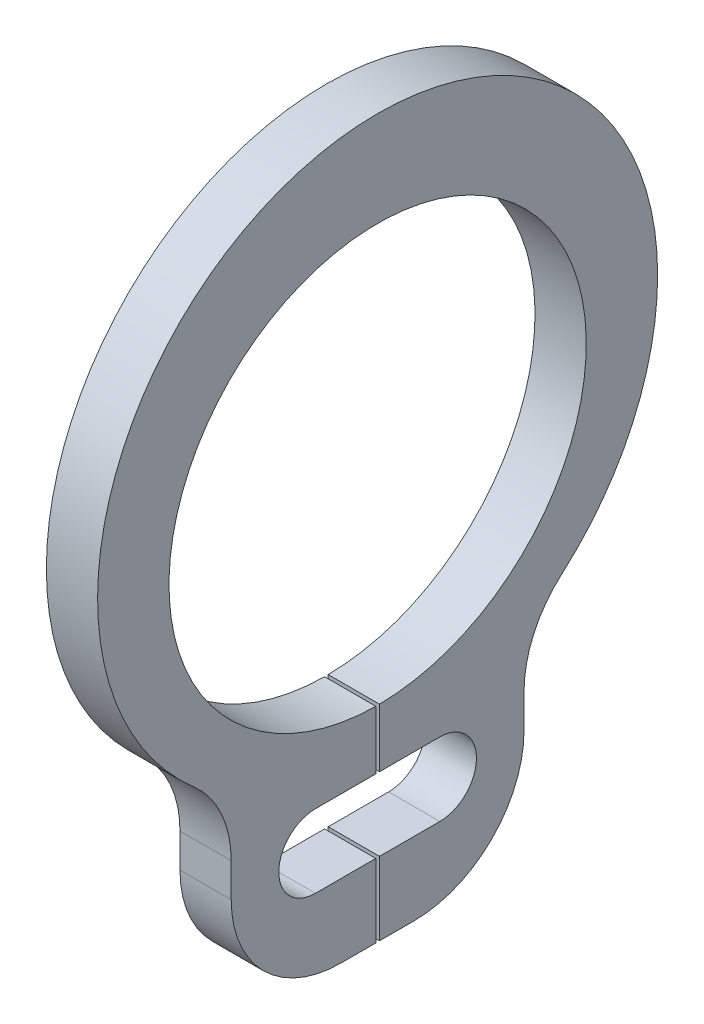
ISO-10303-21;
HEADER;
FILE_DESCRIPTION(('STEP AP214'),'2;1');
FILE_NAME('part.step','',(''),(''),'','','');
FILE_SCHEMA(('AUTOMOTIVE_DESIGN { 1 0 10303 214 1 1 1 1 }'));
ENDSEC;
DATA;
#1=APPLICATION_CONTEXT('core data for automotive mechanical design processes');
#2=APPLICATION_PROTOCOL_DEFINITION('international standard','automotive_design',2000,#1);
#3=PRODUCT_CONTEXT('',#1,'mechanical');
#4=PRODUCT('Part','Part','',(#3));
#5=PRODUCT_RELATED_PRODUCT_CATEGORY('part','',(#4));
#6=PRODUCT_DEFINITION_FORMATION('','',#4);
#7=PRODUCT_DEFINITION_CONTEXT('part definition',#1,'design');
#8=PRODUCT_DEFINITION('design','',#6,#7);
#9=PRODUCT_DEFINITION_SHAPE('','',#8);
#10=(LENGTH_UNIT() NAMED_UNIT(*) SI_UNIT(.MILLI.,.METRE.));
#11=(NAMED_UNIT(*) PLANE_ANGLE_UNIT() SI_UNIT($,.RADIAN.));
#12=(NAMED_UNIT(*) SI_UNIT($,.STERADIAN.) SOLID_ANGLE_UNIT());
#13=UNCERTAINTY_MEASURE_WITH_UNIT(LENGTH_MEASURE(1.E-05),#10,'distance_accuracy_value','');
#14=(GEOMETRIC_REPRESENTATION_CONTEXT(3) GLOBAL_UNCERTAINTY_ASSIGNED_CONTEXT((#13)) GLOBAL_UNIT_ASSIGNED_CONTEXT((#10,
#11,#12)) REPRESENTATION_CONTEXT('',''));
#15=CARTESIAN_POINT('',(0.,0.,0.));
#16=DIRECTION('',(0.,0.,1.));
#17=DIRECTION('',(1.,0.,0.));
#18=AXIS2_PLACEMENT_3D('',#15,#16,#17);
#19=CARTESIAN_POINT('',(4.5,0.,0.));
#20=DIRECTION('',(-1.,0.,0.));
#21=DIRECTION('',(0.,0.,1.));
#22=AXIS2_PLACEMENT_3D('',#19,#20,#21);
#23=PLANE('',#22);
#24=CARTESIAN_POINT('',(4.5,0.325,0.));
#25=DIRECTION('',(-1.,0.,0.));
#26=DIRECTION('',(0.,0.,1.));
#27=AXIS2_PLACEMENT_3D('',#24,#25,#26);
#28=CIRCLE('',#27,3.825);
#29=CARTESIAN_POINT('',(4.5,-2.55770777073399,2.51408450704225));
#30=VERTEX_POINT('',#29);
#31=CARTESIAN_POINT('',(4.5,-2.55770777073399,-2.51408450704225));
#32=VERTEX_POINT('',#31);
#33=EDGE_CURVE('E143',#30,#32,#28,.T.);
#34=ORIENTED_EDGE('',*,*,#33,.F.);
#35=CARTESIAN_POINT('',(4.5,-3.68818140631595,3.5));
#36=DIRECTION('',(-1.,0.,0.));
#37=DIRECTION('',(0.,0.,1.));
#38=AXIS2_PLACEMENT_3D('',#35,#36,#37);
#39=CIRCLE('',#38,1.5);
#40=CARTESIAN_POINT('',(4.5,-3.68818140631595,2.));
#41=VERTEX_POINT('',#40);
#42=EDGE_CURVE('E19',#41,#30,#39,.F.);
#43=ORIENTED_EDGE('',*,*,#42,.F.);
#44=DIRECTION('',(0.,1.,0.));
#45=VECTOR('',#44,1.);
#46=CARTESIAN_POINT('',(4.5,0.,2.));
#47=LINE('',#46,#45);
#48=CARTESIAN_POINT('',(4.5,-4.15,2.));
#49=VERTEX_POINT('',#48);
#50=EDGE_CURVE('E126',#49,#41,#47,.T.);
#51=ORIENTED_EDGE('',*,*,#50,.F.);
#52=CARTESIAN_POINT('',(4.5,-4.15,0.5));
#53=DIRECTION('',(-1.,0.,0.));
#54=DIRECTION('',(0.,0.,1.));
#55=AXIS2_PLACEMENT_3D('',#52,#53,#54);
#56=CIRCLE('',#55,1.5);
#57=CARTESIAN_POINT('',(4.5,-5.65,0.5));
#58=VERTEX_POINT('',#57);
#59=EDGE_CURVE('E171',#58,#49,#56,.T.);
#60=ORIENTED_EDGE('',*,*,#59,.F.);
#61=DIRECTION('',(0.,0.,-1.));
#62=VECTOR('',#61,1.);
#63=CARTESIAN_POINT('',(4.5,-5.65,0.025));
#64=LINE('',#63,#62);
#65=CARTESIAN_POINT('',(4.5,-5.65,0.025));
#66=VERTEX_POINT('',#65);
#67=EDGE_CURVE('E256',#66,#58,#64,.F.);
#68=ORIENTED_EDGE('',*,*,#67,.F.);
#69=DIRECTION('',(0.,1.,0.));
#70=VECTOR('',#69,1.);
#71=CARTESIAN_POINT('',(4.5,-4.65,0.025));
#72=LINE('',#71,#70);
#73=CARTESIAN_POINT('',(4.5,-4.65,0.025));
#74=VERTEX_POINT('',#73);
#75=EDGE_CURVE('E250',#74,#66,#72,.F.);
#76=ORIENTED_EDGE('',*,*,#75,.F.);
#77=DIRECTION('',(0.,0.,1.));
#78=VECTOR('',#77,1.);
#79=CARTESIAN_POINT('',(4.5,-4.65,0.85));
#80=LINE('',#79,#78);
#81=CARTESIAN_POINT('',(4.5,-4.65,0.85));
#82=VERTEX_POINT('',#81);
#83=EDGE_CURVE('E169',#82,#74,#80,.F.);
#84=ORIENTED_EDGE('',*,*,#83,.F.);
#85=CARTESIAN_POINT('',(4.5,-4.15,0.85));
#86=DIRECTION('',(-1.,0.,0.));
#87=DIRECTION('',(0.,0.,1.));
#88=AXIS2_PLACEMENT_3D('',#85,#86,#87);
#89=CIRCLE('',#88,0.5);
#90=CARTESIAN_POINT('',(4.5,-3.65,0.85));
#91=VERTEX_POINT('',#90);
#92=EDGE_CURVE('E166',#82,#91,#89,.T.);
#93=ORIENTED_EDGE('',*,*,#92,.T.);
#94=DIRECTION('',(0.,0.,-1.));
#95=VECTOR('',#94,1.);
#96=CARTESIAN_POINT('',(4.5,-3.65,0.025));
#97=LINE('',#96,#95);
#98=CARTESIAN_POINT('',(4.5,-3.65,0.025));
#99=VERTEX_POINT('',#98);
#100=EDGE_CURVE('E240',#99,#91,#97,.F.);
#101=ORIENTED_EDGE('',*,*,#100,.F.);
#102=DIRECTION('',(0.,1.,0.));
#103=VECTOR('',#102,1.);
#104=CARTESIAN_POINT('',(4.5,-2.84989034876783,0.025));
#105=LINE('',#104,#103);
#106=CARTESIAN_POINT('',(4.5,-2.84989034876783,0.025));
#107=VERTEX_POINT('',#106);
#108=EDGE_CURVE('E164',#107,#99,#105,.F.);
#109=ORIENTED_EDGE('',*,*,#108,.F.);
#110=CARTESIAN_POINT('',(4.5,0.,0.));
#111=DIRECTION('',(-1.,0.,0.));
#112=DIRECTION('',(0.,0.,1.));
#113=AXIS2_PLACEMENT_3D('',#110,#111,#112);
#114=CIRCLE('',#113,2.85);
#115=CARTESIAN_POINT('',(4.5,-2.84989034876783,-0.0250000000000001));
#116=VERTEX_POINT('',#115);
#117=EDGE_CURVE('E162',#107,#116,#114,.T.);
#118=ORIENTED_EDGE('',*,*,#117,.T.);
#119=DIRECTION('',(0.,-1.,0.));
#120=VECTOR('',#119,1.);
#121=CARTESIAN_POINT('',(4.5,-3.65,-0.025));
#122=LINE('',#121,#120);
#123=CARTESIAN_POINT('',(4.5,-3.65,-0.025));
#124=VERTEX_POINT('',#123);
#125=EDGE_CURVE('E229',#124,#116,#122,.F.);
#126=ORIENTED_EDGE('',*,*,#125,.F.);
#127=DIRECTION('',(0.,0.,-1.));
#128=VECTOR('',#127,1.);
#129=CARTESIAN_POINT('',(4.5,-3.65,-0.850000000000002));
#130=LINE('',#129,#128);
#131=CARTESIAN_POINT('',(4.5,-3.65,-0.850000000000002));
#132=VERTEX_POINT('',#131);
#133=EDGE_CURVE('E160',#132,#124,#130,.F.);
#134=ORIENTED_EDGE('',*,*,#133,.F.);
#135=CARTESIAN_POINT('',(4.5,-4.15,-0.850000000000001));
#136=DIRECTION('',(-1.,0.,0.));
#137=DIRECTION('',(0.,0.,1.));
#138=AXIS2_PLACEMENT_3D('',#135,#136,#137);
#139=CIRCLE('',#138,0.499999999999999);
#140=CARTESIAN_POINT('',(4.5,-4.65,-0.850000000000001));
#141=VERTEX_POINT('',#140);
#142=EDGE_CURVE('E157',#132,#141,#139,.T.);
#143=ORIENTED_EDGE('',*,*,#142,.T.);
#144=DIRECTION('',(0.,0.,1.));
#145=VECTOR('',#144,1.);
#146=CARTESIAN_POINT('',(4.5,-4.65,-0.025));
#147=LINE('',#146,#145);
#148=CARTESIAN_POINT('',(4.5,-4.65,-0.025));
#149=VERTEX_POINT('',#148);
#150=EDGE_CURVE('E219',#149,#141,#147,.F.);
#151=ORIENTED_EDGE('',*,*,#150,.F.);
#152=DIRECTION('',(0.,-1.,0.));
#153=VECTOR('',#152,1.);
#154=CARTESIAN_POINT('',(4.5,-5.65,-0.025));
#155=LINE('',#154,#153);
#156=CARTESIAN_POINT('',(4.5,-5.65,-0.025));
#157=VERTEX_POINT('',#156);
#158=EDGE_CURVE('E213',#157,#149,#155,.F.);
#159=ORIENTED_EDGE('',*,*,#158,.F.);
#160=DIRECTION('',(0.,0.,-1.));
#161=VECTOR('',#160,1.);
#162=CARTESIAN_POINT('',(4.5,-5.65,-0.5));
#163=LINE('',#162,#161);
#164=CARTESIAN_POINT('',(4.5,-5.65,-0.5));
#165=VERTEX_POINT('',#164);
#166=EDGE_CURVE('E207',#165,#157,#163,.F.);
#167=ORIENTED_EDGE('',*,*,#166,.F.);
#168=CARTESIAN_POINT('',(4.5,-4.15,-0.499999999999999));
#169=DIRECTION('',(-1.,0.,0.));
#170=DIRECTION('',(0.,0.,1.));
#171=AXIS2_PLACEMENT_3D('',#168,#169,#170);
#172=CIRCLE('',#171,1.5);
#173=CARTESIAN_POINT('',(4.5,-4.15,-2.));
#174=VERTEX_POINT('',#173);
#175=EDGE_CURVE('E152',#174,#165,#172,.T.);
#176=ORIENTED_EDGE('',*,*,#175,.F.);
#177=DIRECTION('',(0.,1.,0.));
#178=VECTOR('',#177,1.);
#179=CARTESIAN_POINT('',(4.5,-3.68818140631594,-2.));
#180=LINE('',#179,#178);
#181=CARTESIAN_POINT('',(4.5,-3.68818140631594,-2.));
#182=VERTEX_POINT('',#181);
#183=EDGE_CURVE('E151',#182,#174,#180,.F.);
#184=ORIENTED_EDGE('',*,*,#183,.F.);
#185=CARTESIAN_POINT('',(4.5,-3.68818140631594,-3.5));
#186=DIRECTION('',(-1.,0.,0.));
#187=DIRECTION('',(0.,0.,1.));
#188=AXIS2_PLACEMENT_3D('',#185,#186,#187);
#189=CIRCLE('',#188,1.5);
#190=EDGE_CURVE('E147',#182,#32,#189,.T.);
#191=ORIENTED_EDGE('',*,*,#190,.T.);
#192=EDGE_LOOP('',(#34,#43,#51,#60,#68,#76,#84,#93,#101,#109,#118,#126,#134,#143,#151,#159,#167,
#176,#184,#191));
#193=FACE_BOUND('',#192,.T.);
#194=ADVANCED_FACE('F16',(#193),#23,.F.);
#195=CARTESIAN_POINT('',(3.8,0.325,0.));
#196=DIRECTION('',(-1.,0.,0.));
#197=DIRECTION('',(0.,0.,1.));
#198=AXIS2_PLACEMENT_3D('',#195,#196,#197);
#199=CYLINDRICAL_SURFACE('',#198,3.825);
#200=DIRECTION('',(-1.,0.,0.));
#201=VECTOR('',#200,1.);
#202=CARTESIAN_POINT('',(3.8,-2.55770777073399,-2.51408450704225));
#203=LINE('',#202,#201);
#204=CARTESIAN_POINT('',(3.8,-2.55770777073399,-2.51408450704225));
#205=VERTEX_POINT('',#204);
#206=EDGE_CURVE('E144',#32,#205,#203,.T.);
#207=ORIENTED_EDGE('',*,*,#206,.T.);
#208=CARTESIAN_POINT('',(3.8,0.325,0.));
#209=DIRECTION('',(-1.,0.,0.));
#210=DIRECTION('',(0.,0.,1.));
#211=AXIS2_PLACEMENT_3D('',#208,#209,#210);
#212=CIRCLE('',#211,3.825);
#213=CARTESIAN_POINT('',(3.8,-2.55770777073399,2.51408450704225));
#214=VERTEX_POINT('',#213);
#215=EDGE_CURVE('E175',#214,#205,#212,.T.);
#216=ORIENTED_EDGE('',*,*,#215,.F.);
#217=DIRECTION('',(-1.,0.,0.));
#218=VECTOR('',#217,1.);
#219=CARTESIAN_POINT('',(3.8,-2.55770777073399,2.51408450704225));
#220=LINE('',#219,#218);
#221=EDGE_CURVE('E139',#214,#30,#220,.F.);
#222=ORIENTED_EDGE('',*,*,#221,.T.);
#223=ORIENTED_EDGE('',*,*,#33,.T.);
#224=EDGE_LOOP('',(#207,#216,#222,#223));
#225=FACE_BOUND('',#224,.T.);
#226=ADVANCED_FACE('F397',(#225),#199,.T.);
#227=CARTESIAN_POINT('',(3.8,-3.68818140631594,-3.5));
#228=DIRECTION('',(-1.,0.,0.));
#229=DIRECTION('',(0.,0.,1.));
#230=AXIS2_PLACEMENT_3D('',#227,#228,#229);
#231=CYLINDRICAL_SURFACE('',#230,1.5);
#232=DIRECTION('',(-1.,0.,0.));
#233=VECTOR('',#232,1.);
#234=CARTESIAN_POINT('',(3.8,-3.68818140631594,-2.));
#235=LINE('',#234,#233);
#236=CARTESIAN_POINT('',(3.8,-3.68818140631594,-2.));
#237=VERTEX_POINT('',#236);
#238=EDGE_CURVE('E156',#237,#182,#235,.F.);
#239=ORIENTED_EDGE('',*,*,#238,.F.);
#240=CARTESIAN_POINT('',(3.8,-3.68818140631594,-3.5));
#241=DIRECTION('',(-1.,0.,0.));
#242=DIRECTION('',(0.,0.,1.));
#243=AXIS2_PLACEMENT_3D('',#240,#241,#242);
#244=CIRCLE('',#243,1.5);
#245=EDGE_CURVE('E177',#205,#237,#244,.F.);
#246=ORIENTED_EDGE('',*,*,#245,.F.);
#247=ORIENTED_EDGE('',*,*,#206,.F.);
#248=ORIENTED_EDGE('',*,*,#190,.F.);
#249=EDGE_LOOP('',(#239,#246,#247,#248));
#250=FACE_BOUND('',#249,.T.);
#251=ADVANCED_FACE('F395',(#250),#231,.F.);
#252=CARTESIAN_POINT('',(3.8,-3.68818140631594,-2.));
#253=DIRECTION('',(0.,0.,-1.));
#254=DIRECTION('',(-1.,0.,0.));
#255=AXIS2_PLACEMENT_3D('',#252,#253,#254);
#256=PLANE('',#255);
#257=DIRECTION('',(0.,1.,0.));
#258=VECTOR('',#257,1.);
#259=CARTESIAN_POINT('',(3.8,0.,-2.));
#260=LINE('',#259,#258);
#261=CARTESIAN_POINT('',(3.8,-4.15,-2.));
#262=VERTEX_POINT('',#261);
#263=EDGE_CURVE('E180',#237,#262,#260,.F.);
#264=ORIENTED_EDGE('',*,*,#263,.F.);
#265=ORIENTED_EDGE('',*,*,#238,.T.);
#266=ORIENTED_EDGE('',*,*,#183,.T.);
#267=DIRECTION('',(-1.,0.,0.));
#268=VECTOR('',#267,1.);
#269=CARTESIAN_POINT('',(3.8,-4.15,-2.));
#270=LINE('',#269,#268);
#271=EDGE_CURVE('E155',#262,#174,#270,.F.);
#272=ORIENTED_EDGE('',*,*,#271,.F.);
#273=EDGE_LOOP('',(#264,#265,#266,#272));
#274=FACE_BOUND('',#273,.T.);
#275=ADVANCED_FACE('F392',(#274),#256,.T.);
#276=CARTESIAN_POINT('',(3.8,-4.15,-0.499999999999999));
#277=DIRECTION('',(-1.,0.,0.));
#278=DIRECTION('',(0.,0.,1.));
#279=AXIS2_PLACEMENT_3D('',#276,#277,#278);
#280=CYLINDRICAL_SURFACE('',#279,1.5);
#281=CARTESIAN_POINT('',(3.8,-4.15,-0.499999999999999));
#282=DIRECTION('',(-1.,0.,0.));
#283=DIRECTION('',(0.,0.,1.));
#284=AXIS2_PLACEMENT_3D('',#281,#282,#283);
#285=CIRCLE('',#284,1.5);
#286=CARTESIAN_POINT('',(3.8,-5.65,-0.5));
#287=VERTEX_POINT('',#286);
#288=EDGE_CURVE('E181',#262,#287,#285,.T.);
#289=ORIENTED_EDGE('',*,*,#288,.F.);
#290=ORIENTED_EDGE('',*,*,#271,.T.);
#291=ORIENTED_EDGE('',*,*,#175,.T.);
#292=DIRECTION('',(1.,0.,0.));
#293=VECTOR('',#292,1.);
#294=CARTESIAN_POINT('',(3.8,-5.65,-0.5));
#295=LINE('',#294,#293);
#296=EDGE_CURVE('E210',#287,#165,#295,.T.);
#297=ORIENTED_EDGE('',*,*,#296,.F.);
#298=EDGE_LOOP('',(#289,#290,#291,#297));
#299=FACE_BOUND('',#298,.T.);
#300=ADVANCED_FACE('F389',(#299),#280,.T.);
#301=CARTESIAN_POINT('',(3.8,-5.65,-0.5));
#302=DIRECTION('',(0.,-1.,0.));
#303=DIRECTION('',(0.,0.,-1.));
#304=AXIS2_PLACEMENT_3D('',#301,#302,#303);
#305=PLANE('',#304);
#306=DIRECTION('',(0.,0.,1.));
#307=VECTOR('',#306,1.);
#308=CARTESIAN_POINT('',(3.8,-5.65,0.));
#309=LINE('',#308,#307);
#310=CARTESIAN_POINT('',(3.8,-5.65,-0.025));
#311=VERTEX_POINT('',#310);
#312=EDGE_CURVE('E184',#287,#311,#309,.T.);
#313=ORIENTED_EDGE('',*,*,#312,.F.);
#314=ORIENTED_EDGE('',*,*,#296,.T.);
#315=ORIENTED_EDGE('',*,*,#166,.T.);
#316=DIRECTION('',(1.,0.,0.));
#317=VECTOR('',#316,1.);
#318=CARTESIAN_POINT('',(3.8,-5.65,-0.025));
#319=LINE('',#318,#317);
#320=EDGE_CURVE('E216',#311,#157,#319,.T.);
#321=ORIENTED_EDGE('',*,*,#320,.F.);
#322=EDGE_LOOP('',(#313,#314,#315,#321));
#323=FACE_BOUND('',#322,.T.);
#324=ADVANCED_FACE('F382',(#323),#305,.T.);
#325=CARTESIAN_POINT('',(3.8,-5.65,-0.025));
#326=DIRECTION('',(0.,0.,1.));
#327=DIRECTION('',(0.,-1.,0.));
#328=AXIS2_PLACEMENT_3D('',#325,#326,#327);
#329=PLANE('',#328);
#330=DIRECTION('',(0.,1.,0.));
#331=VECTOR('',#330,1.);
#332=CARTESIAN_POINT('',(3.8,0.,-0.025));
#333=LINE('',#332,#331);
#334=CARTESIAN_POINT('',(3.8,-4.65,-0.025));
#335=VERTEX_POINT('',#334);
#336=EDGE_CURVE('E271',#311,#335,#333,.T.);
#337=ORIENTED_EDGE('',*,*,#336,.F.);
#338=ORIENTED_EDGE('',*,*,#320,.T.);
#339=ORIENTED_EDGE('',*,*,#158,.T.);
#340=DIRECTION('',(1.,0.,0.));
#341=VECTOR('',#340,1.);
#342=CARTESIAN_POINT('',(3.8,-4.65,-0.025));
#343=LINE('',#342,#341);
#344=EDGE_CURVE('E221',#335,#149,#343,.T.);
#345=ORIENTED_EDGE('',*,*,#344,.F.);
#346=EDGE_LOOP('',(#337,#338,#339,#345));
#347=FACE_BOUND('',#346,.T.);
#348=ADVANCED_FACE('F384',(#347),#329,.T.);
#349=CARTESIAN_POINT('',(3.8,-4.65,-0.025));
#350=DIRECTION('',(0.,1.,0.));
#351=DIRECTION('',(0.,0.,1.));
#352=AXIS2_PLACEMENT_3D('',#349,#350,#351);
#353=PLANE('',#352);
#354=DIRECTION('',(0.,0.,1.));
#355=VECTOR('',#354,1.);
#356=CARTESIAN_POINT('',(3.8,-4.65,0.));
#357=LINE('',#356,#355);
#358=CARTESIAN_POINT('',(3.8,-4.65,-0.850000000000001));
#359=VERTEX_POINT('',#358);
#360=EDGE_CURVE('E189',#335,#359,#357,.F.);
#361=ORIENTED_EDGE('',*,*,#360,.F.);
#362=ORIENTED_EDGE('',*,*,#344,.T.);
#363=ORIENTED_EDGE('',*,*,#150,.T.);
#364=DIRECTION('',(-1.,0.,0.));
#365=VECTOR('',#364,1.);
#366=CARTESIAN_POINT('',(3.8,-4.65,-0.85));
#367=LINE('',#366,#365);
#368=EDGE_CURVE('E161',#141,#359,#367,.T.);
#369=ORIENTED_EDGE('',*,*,#368,.T.);
#370=EDGE_LOOP('',(#361,#362,#363,#369));
#371=FACE_BOUND('',#370,.T.);
#372=ADVANCED_FACE('F451',(#371),#353,.T.);
#373=CARTESIAN_POINT('',(3.8,-4.15,-0.850000000000001));
#374=DIRECTION('',(-1.,0.,0.));
#375=DIRECTION('',(0.,0.,1.));
#376=AXIS2_PLACEMENT_3D('',#373,#374,#375);
#377=CYLINDRICAL_SURFACE('',#376,0.499999999999999);
#378=DIRECTION('',(1.,0.,0.));
#379=VECTOR('',#378,1.);
#380=CARTESIAN_POINT('',(3.8,-3.65,-0.850000000000002));
#381=LINE('',#380,#379);
#382=CARTESIAN_POINT('',(3.8,-3.65,-0.850000000000002));
#383=VERTEX_POINT('',#382);
#384=EDGE_CURVE('E226',#383,#132,#381,.T.);
#385=ORIENTED_EDGE('',*,*,#384,.F.);
#386=CARTESIAN_POINT('',(3.8,-4.15,-0.850000000000001));
#387=DIRECTION('',(-1.,0.,0.));
#388=DIRECTION('',(0.,0.,1.));
#389=AXIS2_PLACEMENT_3D('',#386,#387,#388);
#390=CIRCLE('',#389,0.499999999999999);
#391=EDGE_CURVE('E185',#359,#383,#390,.F.);
#392=ORIENTED_EDGE('',*,*,#391,.F.);
#393=ORIENTED_EDGE('',*,*,#368,.F.);
#394=ORIENTED_EDGE('',*,*,#142,.F.);
#395=EDGE_LOOP('',(#385,#392,#393,#394));
#396=FACE_BOUND('',#395,.T.);
#397=ADVANCED_FACE('F447',(#396),#377,.F.);
#398=CARTESIAN_POINT('',(3.8,-3.65,-0.850000000000002));
#399=DIRECTION('',(0.,-1.,0.));
#400=DIRECTION('',(0.,0.,-1.));
#401=AXIS2_PLACEMENT_3D('',#398,#399,#400);
#402=PLANE('',#401);
#403=DIRECTION('',(0.,0.,1.));
#404=VECTOR('',#403,1.);
#405=CARTESIAN_POINT('',(3.8,-3.65,0.));
#406=LINE('',#405,#404);
#407=CARTESIAN_POINT('',(3.8,-3.65,-0.025));
#408=VERTEX_POINT('',#407);
#409=EDGE_CURVE('E188',#383,#408,#406,.T.);
#410=ORIENTED_EDGE('',*,*,#409,.F.);
#411=ORIENTED_EDGE('',*,*,#384,.T.);
#412=ORIENTED_EDGE('',*,*,#133,.T.);
#413=DIRECTION('',(1.,0.,0.));
#414=VECTOR('',#413,1.);
#415=CARTESIAN_POINT('',(3.8,-3.65,-0.025));
#416=LINE('',#415,#414);
#417=EDGE_CURVE('E232',#408,#124,#416,.T.);
#418=ORIENTED_EDGE('',*,*,#417,.F.);
#419=EDGE_LOOP('',(#410,#411,#412,#418));
#420=FACE_BOUND('',#419,.T.);
#421=ADVANCED_FACE('F443',(#420),#402,.T.);
#422=CARTESIAN_POINT('',(3.8,-3.65,-0.025));
#423=DIRECTION('',(0.,0.,1.));
#424=DIRECTION('',(0.,-1.,0.));
#425=AXIS2_PLACEMENT_3D('',#422,#423,#424);
#426=PLANE('',#425);
#427=DIRECTION('',(0.,1.,0.));
#428=VECTOR('',#427,1.);
#429=CARTESIAN_POINT('',(3.8,0.,-0.025));
#430=LINE('',#429,#428);
#431=CARTESIAN_POINT('',(3.8,-2.84989034876783,-0.0250000000000001));
#432=VERTEX_POINT('',#431);
#433=EDGE_CURVE('E193',#408,#432,#430,.T.);
#434=ORIENTED_EDGE('',*,*,#433,.F.);
#435=ORIENTED_EDGE('',*,*,#417,.T.);
#436=ORIENTED_EDGE('',*,*,#125,.T.);
#437=DIRECTION('',(-1.,0.,0.));
#438=VECTOR('',#437,1.);
#439=CARTESIAN_POINT('',(3.8,-2.84989034876783,-0.0250000000000002));
#440=LINE('',#439,#438);
#441=EDGE_CURVE('E165',#116,#432,#440,.T.);
#442=ORIENTED_EDGE('',*,*,#441,.T.);
#443=EDGE_LOOP('',(#434,#435,#436,#442));
#444=FACE_BOUND('',#443,.T.);
#445=ADVANCED_FACE('F439',(#444),#426,.T.);
#446=CARTESIAN_POINT('',(3.8,0.,0.));
#447=DIRECTION('',(-1.,0.,0.));
#448=DIRECTION('',(0.,0.,1.));
#449=AXIS2_PLACEMENT_3D('',#446,#447,#448);
#450=CYLINDRICAL_SURFACE('',#449,2.85);
#451=ORIENTED_EDGE('',*,*,#117,.F.);
#452=DIRECTION('',(-1.,0.,0.));
#453=VECTOR('',#452,1.);
#454=CARTESIAN_POINT('',(3.8,-2.84989034876783,0.025));
#455=LINE('',#454,#453);
#456=CARTESIAN_POINT('',(3.8,-2.84989034876783,0.025));
#457=VERTEX_POINT('',#456);
#458=EDGE_CURVE('E237',#457,#107,#455,.F.);
#459=ORIENTED_EDGE('',*,*,#458,.F.);
#460=CARTESIAN_POINT('',(3.8,0.,0.));
#461=DIRECTION('',(-1.,0.,0.));
#462=DIRECTION('',(0.,0.,1.));
#463=AXIS2_PLACEMENT_3D('',#460,#461,#462);
#464=CIRCLE('',#463,2.85);
#465=EDGE_CURVE('E190',#432,#457,#464,.F.);
#466=ORIENTED_EDGE('',*,*,#465,.F.);
#467=ORIENTED_EDGE('',*,*,#441,.F.);
#468=EDGE_LOOP('',(#451,#459,#466,#467));
#469=FACE_BOUND('',#468,.T.);
#470=ADVANCED_FACE('F435',(#469),#450,.F.);
#471=CARTESIAN_POINT('',(3.8,-2.84989034876783,0.025));
#472=DIRECTION('',(0.,0.,-1.));
#473=DIRECTION('',(-1.,0.,0.));
#474=AXIS2_PLACEMENT_3D('',#471,#472,#473);
#475=PLANE('',#474);
#476=DIRECTION('',(0.,1.,0.));
#477=VECTOR('',#476,1.);
#478=CARTESIAN_POINT('',(3.8,0.,0.025));
#479=LINE('',#478,#477);
#480=CARTESIAN_POINT('',(3.8,-3.65,0.025));
#481=VERTEX_POINT('',#480);
#482=EDGE_CURVE('E192',#457,#481,#479,.F.);
#483=ORIENTED_EDGE('',*,*,#482,.F.);
#484=ORIENTED_EDGE('',*,*,#458,.T.);
#485=ORIENTED_EDGE('',*,*,#108,.T.);
#486=DIRECTION('',(1.,0.,0.));
#487=VECTOR('',#486,1.);
#488=CARTESIAN_POINT('',(3.8,-3.65,0.025));
#489=LINE('',#488,#487);
#490=EDGE_CURVE('E242',#481,#99,#489,.T.);
#491=ORIENTED_EDGE('',*,*,#490,.F.);
#492=EDGE_LOOP('',(#483,#484,#485,#491));
#493=FACE_BOUND('',#492,.T.);
#494=ADVANCED_FACE('F431',(#493),#475,.T.);
#495=CARTESIAN_POINT('',(3.8,-3.65,0.025));
#496=DIRECTION('',(0.,-1.,0.));
#497=DIRECTION('',(0.,0.,-1.));
#498=AXIS2_PLACEMENT_3D('',#495,#496,#497);
#499=PLANE('',#498);
#500=DIRECTION('',(0.,0.,1.));
#501=VECTOR('',#500,1.);
#502=CARTESIAN_POINT('',(3.8,-3.65,0.));
#503=LINE('',#502,#501);
#504=CARTESIAN_POINT('',(3.8,-3.65,0.85));
#505=VERTEX_POINT('',#504);
#506=EDGE_CURVE('E198',#481,#505,#503,.T.);
#507=ORIENTED_EDGE('',*,*,#506,.F.);
#508=ORIENTED_EDGE('',*,*,#490,.T.);
#509=ORIENTED_EDGE('',*,*,#100,.T.);
#510=DIRECTION('',(-1.,0.,0.));
#511=VECTOR('',#510,1.);
#512=CARTESIAN_POINT('',(3.8,-3.65,0.85));
#513=LINE('',#512,#511);
#514=EDGE_CURVE('E170',#91,#505,#513,.T.);
#515=ORIENTED_EDGE('',*,*,#514,.T.);
#516=EDGE_LOOP('',(#507,#508,#509,#515));
#517=FACE_BOUND('',#516,.T.);
#518=ADVANCED_FACE('F427',(#517),#499,.T.);
#519=CARTESIAN_POINT('',(3.8,-4.15,0.85));
#520=DIRECTION('',(-1.,0.,0.));
#521=DIRECTION('',(0.,0.,1.));
#522=AXIS2_PLACEMENT_3D('',#519,#520,#521);
#523=CYLINDRICAL_SURFACE('',#522,0.5);
#524=DIRECTION('',(1.,0.,0.));
#525=VECTOR('',#524,1.);
#526=CARTESIAN_POINT('',(3.8,-4.65,0.85));
#527=LINE('',#526,#525);
#528=CARTESIAN_POINT('',(3.8,-4.65,0.85));
#529=VERTEX_POINT('',#528);
#530=EDGE_CURVE('E247',#529,#82,#527,.T.);
#531=ORIENTED_EDGE('',*,*,#530,.F.);
#532=CARTESIAN_POINT('',(3.8,-4.15,0.85));
#533=DIRECTION('',(-1.,0.,0.));
#534=DIRECTION('',(0.,0.,1.));
#535=AXIS2_PLACEMENT_3D('',#532,#533,#534);
#536=CIRCLE('',#535,0.5);
#537=EDGE_CURVE('E194',#505,#529,#536,.F.);
#538=ORIENTED_EDGE('',*,*,#537,.F.);
#539=ORIENTED_EDGE('',*,*,#514,.F.);
#540=ORIENTED_EDGE('',*,*,#92,.F.);
#541=EDGE_LOOP('',(#531,#538,#539,#540));
#542=FACE_BOUND('',#541,.T.);
#543=ADVANCED_FACE('F423',(#542),#523,.F.);
#544=CARTESIAN_POINT('',(3.8,-4.65,0.85));
#545=DIRECTION('',(0.,1.,0.));
#546=DIRECTION('',(0.,0.,1.));
#547=AXIS2_PLACEMENT_3D('',#544,#545,#546);
#548=PLANE('',#547);
#549=DIRECTION('',(0.,0.,1.));
#550=VECTOR('',#549,1.);
#551=CARTESIAN_POINT('',(3.8,-4.65,0.));
#552=LINE('',#551,#550);
#553=CARTESIAN_POINT('',(3.8,-4.65,0.025));
#554=VERTEX_POINT('',#553);
#555=EDGE_CURVE('E197',#529,#554,#552,.F.);
#556=ORIENTED_EDGE('',*,*,#555,.F.);
#557=ORIENTED_EDGE('',*,*,#530,.T.);
#558=ORIENTED_EDGE('',*,*,#83,.T.);
#559=DIRECTION('',(1.,0.,0.));
#560=VECTOR('',#559,1.);
#561=CARTESIAN_POINT('',(3.8,-4.65,0.025));
#562=LINE('',#561,#560);
#563=EDGE_CURVE('E252',#554,#74,#562,.T.);
#564=ORIENTED_EDGE('',*,*,#563,.F.);
#565=EDGE_LOOP('',(#556,#557,#558,#564));
#566=FACE_BOUND('',#565,.T.);
#567=ADVANCED_FACE('F420',(#566),#548,.T.);
#568=CARTESIAN_POINT('',(3.8,-4.65,0.025));
#569=DIRECTION('',(0.,0.,-1.));
#570=DIRECTION('',(0.,1.,0.));
#571=AXIS2_PLACEMENT_3D('',#568,#569,#570);
#572=PLANE('',#571);
#573=DIRECTION('',(0.,1.,0.));
#574=VECTOR('',#573,1.);
#575=CARTESIAN_POINT('',(3.8,0.,0.025));
#576=LINE('',#575,#574);
#577=CARTESIAN_POINT('',(3.8,-5.65,0.025));
#578=VERTEX_POINT('',#577);
#579=EDGE_CURVE('E301',#554,#578,#576,.F.);
#580=ORIENTED_EDGE('',*,*,#579,.F.);
#581=ORIENTED_EDGE('',*,*,#563,.T.);
#582=ORIENTED_EDGE('',*,*,#75,.T.);
#583=DIRECTION('',(1.,0.,0.));
#584=VECTOR('',#583,1.);
#585=CARTESIAN_POINT('',(3.8,-5.65,0.025));
#586=LINE('',#585,#584);
#587=EDGE_CURVE('E174',#578,#66,#586,.T.);
#588=ORIENTED_EDGE('',*,*,#587,.F.);
#589=EDGE_LOOP('',(#580,#581,#582,#588));
#590=FACE_BOUND('',#589,.T.);
#591=ADVANCED_FACE('F360',(#590),#572,.T.);
#592=CARTESIAN_POINT('',(3.8,-5.65,0.025));
#593=DIRECTION('',(0.,-1.,0.));
#594=DIRECTION('',(0.,0.,-1.));
#595=AXIS2_PLACEMENT_3D('',#592,#593,#594);
#596=PLANE('',#595);
#597=DIRECTION('',(0.,0.,1.));
#598=VECTOR('',#597,1.);
#599=CARTESIAN_POINT('',(3.8,-5.65,0.));
#600=LINE('',#599,#598);
#601=CARTESIAN_POINT('',(3.8,-5.65,0.5));
#602=VERTEX_POINT('',#601);
#603=EDGE_CURVE('E201',#578,#602,#600,.T.);
#604=ORIENTED_EDGE('',*,*,#603,.F.);
#605=ORIENTED_EDGE('',*,*,#587,.T.);
#606=ORIENTED_EDGE('',*,*,#67,.T.);
#607=DIRECTION('',(-1.,0.,0.));
#608=VECTOR('',#607,1.);
#609=CARTESIAN_POINT('',(3.8,-5.65,0.5));
#610=LINE('',#609,#608);
#611=EDGE_CURVE('E173',#602,#58,#610,.F.);
#612=ORIENTED_EDGE('',*,*,#611,.F.);
#613=EDGE_LOOP('',(#604,#605,#606,#612));
#614=FACE_BOUND('',#613,.T.);
#615=ADVANCED_FACE('F355',(#614),#596,.T.);
#616=CARTESIAN_POINT('',(3.8,-4.15,0.5));
#617=DIRECTION('',(-1.,0.,0.));
#618=DIRECTION('',(0.,0.,1.));
#619=AXIS2_PLACEMENT_3D('',#616,#617,#618);
#620=CYLINDRICAL_SURFACE('',#619,1.5);
#621=CARTESIAN_POINT('',(3.8,-4.15,0.5));
#622=DIRECTION('',(-1.,0.,0.));
#623=DIRECTION('',(0.,0.,1.));
#624=AXIS2_PLACEMENT_3D('',#621,#622,#623);
#625=CIRCLE('',#624,1.5);
#626=CARTESIAN_POINT('',(3.8,-4.15,2.));
#627=VERTEX_POINT('',#626);
#628=EDGE_CURVE('E199',#602,#627,#625,.T.);
#629=ORIENTED_EDGE('',*,*,#628,.F.);
#630=ORIENTED_EDGE('',*,*,#611,.T.);
#631=ORIENTED_EDGE('',*,*,#59,.T.);
#632=DIRECTION('',(1.,0.,0.));
#633=VECTOR('',#632,1.);
#634=CARTESIAN_POINT('',(3.8,-4.15,2.));
#635=LINE('',#634,#633);
#636=EDGE_CURVE('E128',#627,#49,#635,.T.);
#637=ORIENTED_EDGE('',*,*,#636,.F.);
#638=EDGE_LOOP('',(#629,#630,#631,#637));
#639=FACE_BOUND('',#638,.T.);
#640=ADVANCED_FACE('F351',(#639),#620,.T.);
#641=CARTESIAN_POINT('',(3.8,-4.15,2.));
#642=DIRECTION('',(0.,0.,1.));
#643=DIRECTION('',(1.,0.,0.));
#644=AXIS2_PLACEMENT_3D('',#641,#642,#643);
#645=PLANE('',#644);
#646=DIRECTION('',(0.,1.,0.));
#647=VECTOR('',#646,1.);
#648=CARTESIAN_POINT('',(3.8,0.,2.));
#649=LINE('',#648,#647);
#650=CARTESIAN_POINT('',(3.8,-3.68818140631595,2.));
#651=VERTEX_POINT('',#650);
#652=EDGE_CURVE('E25',#627,#651,#649,.T.);
#653=ORIENTED_EDGE('',*,*,#652,.F.);
#654=ORIENTED_EDGE('',*,*,#636,.T.);
#655=ORIENTED_EDGE('',*,*,#50,.T.);
#656=DIRECTION('',(-1.,0.,0.));
#657=VECTOR('',#656,1.);
#658=CARTESIAN_POINT('',(3.8,-3.68818140631594,2.));
#659=LINE('',#658,#657);
#660=EDGE_CURVE('E34',#41,#651,#659,.T.);
#661=ORIENTED_EDGE('',*,*,#660,.T.);
#662=EDGE_LOOP('',(#653,#654,#655,#661));
#663=FACE_BOUND('',#662,.T.);
#664=ADVANCED_FACE('F127',(#663),#645,.T.);
#665=CARTESIAN_POINT('',(3.8,-3.68818140631595,3.5));
#666=DIRECTION('',(-1.,0.,0.));
#667=DIRECTION('',(0.,0.,1.));
#668=AXIS2_PLACEMENT_3D('',#665,#666,#667);
#669=CYLINDRICAL_SURFACE('',#668,1.5);
#670=ORIENTED_EDGE('',*,*,#221,.F.);
#671=CARTESIAN_POINT('',(3.8,-3.68818140631595,3.5));
#672=DIRECTION('',(-1.,0.,0.));
#673=DIRECTION('',(0.,0.,1.));
#674=AXIS2_PLACEMENT_3D('',#671,#672,#673);
#675=CIRCLE('',#674,1.5);
#676=EDGE_CURVE('E10',#651,#214,#675,.F.);
#677=ORIENTED_EDGE('',*,*,#676,.F.);
#678=ORIENTED_EDGE('',*,*,#660,.F.);
#679=ORIENTED_EDGE('',*,*,#42,.T.);
#680=EDGE_LOOP('',(#670,#677,#678,#679));
#681=FACE_BOUND('',#680,.T.);
#682=ADVANCED_FACE('F136',(#681),#669,.F.);
#683=CARTESIAN_POINT('',(3.8,0.,0.));
#684=DIRECTION('',(-1.,0.,0.));
#685=DIRECTION('',(0.,0.,1.));
#686=AXIS2_PLACEMENT_3D('',#683,#684,#685);
#687=PLANE('',#686);
#688=ORIENTED_EDGE('',*,*,#652,.T.);
#689=ORIENTED_EDGE('',*,*,#676,.T.);
#690=ORIENTED_EDGE('',*,*,#215,.T.);
#691=ORIENTED_EDGE('',*,*,#245,.T.);
#692=ORIENTED_EDGE('',*,*,#263,.T.);
#693=ORIENTED_EDGE('',*,*,#288,.T.);
#694=ORIENTED_EDGE('',*,*,#312,.T.);
#695=ORIENTED_EDGE('',*,*,#336,.T.);
#696=ORIENTED_EDGE('',*,*,#360,.T.);
#697=ORIENTED_EDGE('',*,*,#391,.T.);
#698=ORIENTED_EDGE('',*,*,#409,.T.);
#699=ORIENTED_EDGE('',*,*,#433,.T.);
#700=ORIENTED_EDGE('',*,*,#465,.T.);
#701=ORIENTED_EDGE('',*,*,#482,.T.);
#702=ORIENTED_EDGE('',*,*,#506,.T.);
#703=ORIENTED_EDGE('',*,*,#537,.T.);
#704=ORIENTED_EDGE('',*,*,#555,.T.);
#705=ORIENTED_EDGE('',*,*,#579,.T.);
#706=ORIENTED_EDGE('',*,*,#603,.T.);
#707=ORIENTED_EDGE('',*,*,#628,.T.);
#708=EDGE_LOOP('',(#688,#689,#690,#691,#692,#693,#694,#695,#696,#697,#698,#699,#700,#701,#702,
#703,#704,#705,#706,#707));
#709=FACE_BOUND('',#708,.T.);
#710=ADVANCED_FACE('F347',(#709),#687,.T.);
#711=CLOSED_SHELL('',(#194,#226,#251,#275,#300,#324,#348,#372,#397,#421,#445,#470,#494,#518,
#543,#567,#591,#615,#640,#664,#682,#710));
#712=MANIFOLD_SOLID_BREP('B1',#711);
#713=ADVANCED_BREP_SHAPE_REPRESENTATION('',(#18,#712),#14);
#714=SHAPE_DEFINITION_REPRESENTATION(#9,#713);
ENDSEC;
END-ISO-10303-21;
